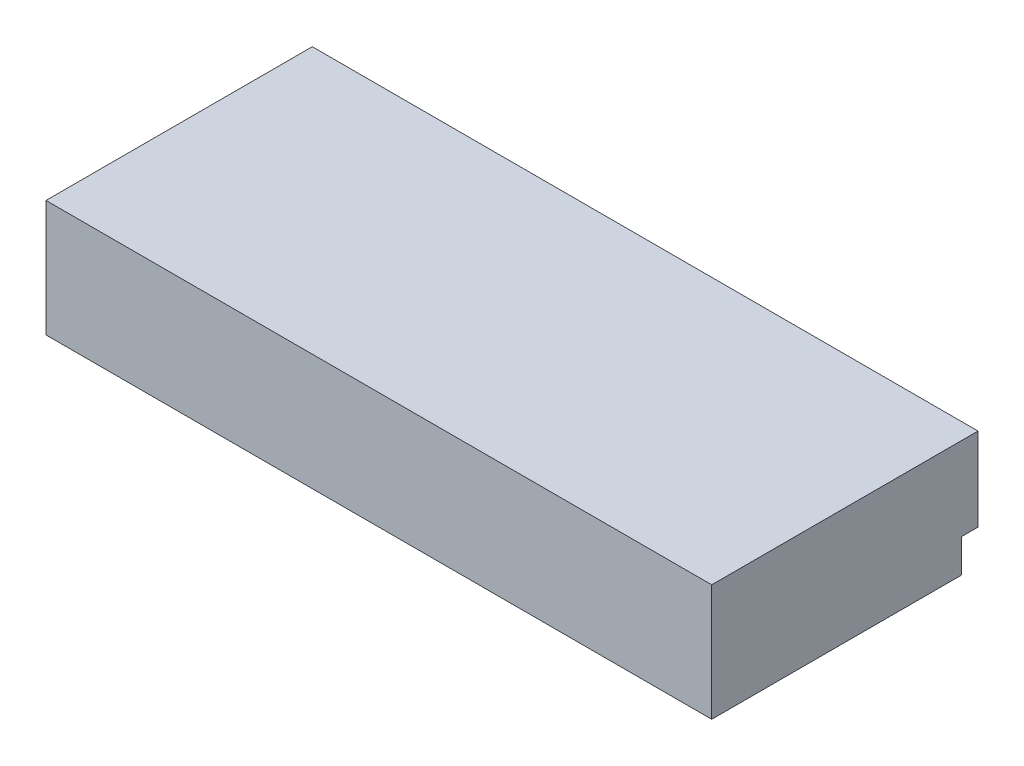
ISO-10303-21;
HEADER;
FILE_DESCRIPTION(('STEP AP214'),'2;1');
FILE_NAME('part.step','',(''),(''),'','','');
FILE_SCHEMA(('AUTOMOTIVE_DESIGN { 1 0 10303 214 1 1 1 1 }'));
ENDSEC;
DATA;
#1=APPLICATION_CONTEXT('core data for automotive mechanical design processes');
#2=APPLICATION_PROTOCOL_DEFINITION('international standard','automotive_design',2000,#1);
#3=PRODUCT_CONTEXT('',#1,'mechanical');
#4=PRODUCT('Part','Part','',(#3));
#5=PRODUCT_RELATED_PRODUCT_CATEGORY('part','',(#4));
#6=PRODUCT_DEFINITION_FORMATION('','',#4);
#7=PRODUCT_DEFINITION_CONTEXT('part definition',#1,'design');
#8=PRODUCT_DEFINITION('design','',#6,#7);
#9=PRODUCT_DEFINITION_SHAPE('','',#8);
#10=(LENGTH_UNIT() NAMED_UNIT(*) SI_UNIT(.MILLI.,.METRE.));
#11=(NAMED_UNIT(*) PLANE_ANGLE_UNIT() SI_UNIT($,.RADIAN.));
#12=(NAMED_UNIT(*) SI_UNIT($,.STERADIAN.) SOLID_ANGLE_UNIT());
#13=UNCERTAINTY_MEASURE_WITH_UNIT(LENGTH_MEASURE(1.E-05),#10,'distance_accuracy_value','');
#14=(GEOMETRIC_REPRESENTATION_CONTEXT(3) GLOBAL_UNCERTAINTY_ASSIGNED_CONTEXT((#13)) GLOBAL_UNIT_ASSIGNED_CONTEXT((#10,
#11,#12)) REPRESENTATION_CONTEXT('',''));
#15=CARTESIAN_POINT('',(0.,0.,0.));
#16=DIRECTION('',(0.,0.,1.));
#17=DIRECTION('',(1.,0.,0.));
#18=AXIS2_PLACEMENT_3D('',#15,#16,#17);
#19=CARTESIAN_POINT('',(100.,35.,40.));
#20=DIRECTION('',(-1.,0.,0.));
#21=DIRECTION('',(0.,0.,1.));
#22=AXIS2_PLACEMENT_3D('',#19,#20,#21);
#23=PLANE('',#22);
#24=DIRECTION('',(0.,0.,-1.));
#25=VECTOR('',#24,1.);
#26=CARTESIAN_POINT('',(100.,0.,40.));
#27=LINE('',#26,#25);
#28=CARTESIAN_POINT('',(100.,0.,40.));
#29=VERTEX_POINT('',#28);
#30=CARTESIAN_POINT('',(100.,0.,-35.));
#31=VERTEX_POINT('',#30);
#32=EDGE_CURVE('E123',#29,#31,#27,.T.);
#33=ORIENTED_EDGE('',*,*,#32,.T.);
#34=DIRECTION('',(0.,-1.,0.));
#35=VECTOR('',#34,1.);
#36=CARTESIAN_POINT('',(100.,0.,-35.));
#37=LINE('',#36,#35);
#38=CARTESIAN_POINT('',(100.,9.99999999999999,-35.));
#39=VERTEX_POINT('',#38);
#40=EDGE_CURVE('E48',#39,#31,#37,.T.);
#41=ORIENTED_EDGE('',*,*,#40,.F.);
#42=DIRECTION('',(0.,0.,1.));
#43=VECTOR('',#42,1.);
#44=CARTESIAN_POINT('',(100.,9.99999999999998,-40.));
#45=LINE('',#44,#43);
#46=CARTESIAN_POINT('',(100.,9.99999999999998,-40.));
#47=VERTEX_POINT('',#46);
#48=EDGE_CURVE('E134',#47,#39,#45,.T.);
#49=ORIENTED_EDGE('',*,*,#48,.F.);
#50=DIRECTION('',(0.,-1.,0.));
#51=VECTOR('',#50,1.);
#52=CARTESIAN_POINT('',(99.9999999999999,35.,-40.));
#53=LINE('',#52,#51);
#54=CARTESIAN_POINT('',(99.9999999999999,35.,-40.));
#55=VERTEX_POINT('',#54);
#56=EDGE_CURVE('E11',#55,#47,#53,.T.);
#57=ORIENTED_EDGE('',*,*,#56,.F.);
#58=DIRECTION('',(0.,0.,-1.));
#59=VECTOR('',#58,1.);
#60=CARTESIAN_POINT('',(100.,35.,40.));
#61=LINE('',#60,#59);
#62=CARTESIAN_POINT('',(100.,35.,40.));
#63=VERTEX_POINT('',#62);
#64=EDGE_CURVE('E120',#63,#55,#61,.T.);
#65=ORIENTED_EDGE('',*,*,#64,.F.);
#66=DIRECTION('',(0.,-1.,0.));
#67=VECTOR('',#66,1.);
#68=CARTESIAN_POINT('',(100.,35.,40.));
#69=LINE('',#68,#67);
#70=EDGE_CURVE('E115',#63,#29,#69,.T.);
#71=ORIENTED_EDGE('',*,*,#70,.T.);
#72=EDGE_LOOP('',(#33,#41,#49,#57,#65,#71));
#73=FACE_BOUND('',#72,.T.);
#74=ADVANCED_FACE('F34',(#73),#23,.F.);
#75=CARTESIAN_POINT('',(-99.9999999999999,35.,-40.));
#76=DIRECTION('',(0.,0.,1.));
#77=DIRECTION('',(1.,0.,0.));
#78=AXIS2_PLACEMENT_3D('',#75,#76,#77);
#79=PLANE('',#78);
#80=ORIENTED_EDGE('',*,*,#56,.T.);
#81=DIRECTION('',(1.,0.,0.));
#82=VECTOR('',#81,1.);
#83=CARTESIAN_POINT('',(-100.,10.,-40.));
#84=LINE('',#83,#82);
#85=CARTESIAN_POINT('',(-100.,10.,-40.));
#86=VERTEX_POINT('',#85);
#87=EDGE_CURVE('E98',#86,#47,#84,.T.);
#88=ORIENTED_EDGE('',*,*,#87,.F.);
#89=DIRECTION('',(0.,-1.,0.));
#90=VECTOR('',#89,1.);
#91=CARTESIAN_POINT('',(-99.9999999999999,35.,-40.));
#92=LINE('',#91,#90);
#93=CARTESIAN_POINT('',(-99.9999999999999,35.,-40.));
#94=VERTEX_POINT('',#93);
#95=EDGE_CURVE('E41',#94,#86,#92,.T.);
#96=ORIENTED_EDGE('',*,*,#95,.F.);
#97=DIRECTION('',(-1.,0.,0.));
#98=VECTOR('',#97,1.);
#99=CARTESIAN_POINT('',(-99.9999999999999,35.,-40.));
#100=LINE('',#99,#98);
#101=EDGE_CURVE('E79',#55,#94,#100,.T.);
#102=ORIENTED_EDGE('',*,*,#101,.F.);
#103=EDGE_LOOP('',(#80,#88,#96,#102));
#104=FACE_BOUND('',#103,.T.);
#105=ADVANCED_FACE('F107',(#104),#79,.F.);
#106=CARTESIAN_POINT('',(-100.,35.,40.));
#107=DIRECTION('',(1.,0.,0.));
#108=DIRECTION('',(0.,0.,-1.));
#109=AXIS2_PLACEMENT_3D('',#106,#107,#108);
#110=PLANE('',#109);
#111=DIRECTION('',(0.,0.,1.));
#112=VECTOR('',#111,1.);
#113=CARTESIAN_POINT('',(-100.,10.,-40.));
#114=LINE('',#113,#112);
#115=CARTESIAN_POINT('',(-100.,10.,-35.));
#116=VERTEX_POINT('',#115);
#117=EDGE_CURVE('E94',#86,#116,#114,.T.);
#118=ORIENTED_EDGE('',*,*,#117,.T.);
#119=DIRECTION('',(0.,-1.,0.));
#120=VECTOR('',#119,1.);
#121=CARTESIAN_POINT('',(-100.,0.,-35.));
#122=LINE('',#121,#120);
#123=CARTESIAN_POINT('',(-100.,0.,-35.));
#124=VERTEX_POINT('',#123);
#125=EDGE_CURVE('E105',#116,#124,#122,.T.);
#126=ORIENTED_EDGE('',*,*,#125,.T.);
#127=DIRECTION('',(0.,0.,1.));
#128=VECTOR('',#127,1.);
#129=CARTESIAN_POINT('',(-100.,0.,40.));
#130=LINE('',#129,#128);
#131=CARTESIAN_POINT('',(-100.,0.,40.));
#132=VERTEX_POINT('',#131);
#133=EDGE_CURVE('E121',#124,#132,#130,.T.);
#134=ORIENTED_EDGE('',*,*,#133,.T.);
#135=DIRECTION('',(0.,-1.,0.));
#136=VECTOR('',#135,1.);
#137=CARTESIAN_POINT('',(-100.,35.,40.));
#138=LINE('',#137,#136);
#139=CARTESIAN_POINT('',(-100.,35.,40.));
#140=VERTEX_POINT('',#139);
#141=EDGE_CURVE('E114',#140,#132,#138,.T.);
#142=ORIENTED_EDGE('',*,*,#141,.F.);
#143=DIRECTION('',(0.,0.,1.));
#144=VECTOR('',#143,1.);
#145=CARTESIAN_POINT('',(-100.,35.,40.));
#146=LINE('',#145,#144);
#147=EDGE_CURVE('E113',#94,#140,#146,.T.);
#148=ORIENTED_EDGE('',*,*,#147,.F.);
#149=ORIENTED_EDGE('',*,*,#95,.T.);
#150=EDGE_LOOP('',(#118,#126,#134,#142,#148,#149));
#151=FACE_BOUND('',#150,.T.);
#152=ADVANCED_FACE('F111',(#151),#110,.F.);
#153=CARTESIAN_POINT('',(-100.,35.,40.));
#154=DIRECTION('',(0.,0.,-1.));
#155=DIRECTION('',(-1.,0.,0.));
#156=AXIS2_PLACEMENT_3D('',#153,#154,#155);
#157=PLANE('',#156);
#158=DIRECTION('',(1.,0.,0.));
#159=VECTOR('',#158,1.);
#160=CARTESIAN_POINT('',(-100.,0.,40.));
#161=LINE('',#160,#159);
#162=EDGE_CURVE('E72',#132,#29,#161,.T.);
#163=ORIENTED_EDGE('',*,*,#162,.T.);
#164=ORIENTED_EDGE('',*,*,#70,.F.);
#165=DIRECTION('',(1.,0.,0.));
#166=VECTOR('',#165,1.);
#167=CARTESIAN_POINT('',(-100.,35.,40.));
#168=LINE('',#167,#166);
#169=EDGE_CURVE('E57',#140,#63,#168,.T.);
#170=ORIENTED_EDGE('',*,*,#169,.F.);
#171=ORIENTED_EDGE('',*,*,#141,.T.);
#172=EDGE_LOOP('',(#163,#164,#170,#171));
#173=FACE_BOUND('',#172,.T.);
#174=ADVANCED_FACE('F142',(#173),#157,.F.);
#175=CARTESIAN_POINT('',(0.,35.,0.));
#176=DIRECTION('',(0.,-1.,0.));
#177=DIRECTION('',(0.,0.,-1.));
#178=AXIS2_PLACEMENT_3D('',#175,#176,#177);
#179=PLANE('',#178);
#180=ORIENTED_EDGE('',*,*,#64,.T.);
#181=ORIENTED_EDGE('',*,*,#101,.T.);
#182=ORIENTED_EDGE('',*,*,#147,.T.);
#183=ORIENTED_EDGE('',*,*,#169,.T.);
#184=EDGE_LOOP('',(#180,#181,#182,#183));
#185=FACE_BOUND('',#184,.T.);
#186=ADVANCED_FACE('F144',(#185),#179,.F.);
#187=CARTESIAN_POINT('',(0.,0.,0.));
#188=DIRECTION('',(0.,-1.,0.));
#189=DIRECTION('',(0.,0.,-1.));
#190=AXIS2_PLACEMENT_3D('',#187,#188,#189);
#191=PLANE('',#190);
#192=DIRECTION('',(1.,0.,0.));
#193=VECTOR('',#192,1.);
#194=CARTESIAN_POINT('',(-100.,0.,-35.));
#195=LINE('',#194,#193);
#196=EDGE_CURVE('E126',#124,#31,#195,.T.);
#197=ORIENTED_EDGE('',*,*,#196,.T.);
#198=ORIENTED_EDGE('',*,*,#32,.F.);
#199=ORIENTED_EDGE('',*,*,#162,.F.);
#200=ORIENTED_EDGE('',*,*,#133,.F.);
#201=EDGE_LOOP('',(#197,#198,#199,#200));
#202=FACE_BOUND('',#201,.T.);
#203=ADVANCED_FACE('F138',(#202),#191,.T.);
#204=CARTESIAN_POINT('',(-100.,0.,-35.));
#205=DIRECTION('',(0.,0.,1.));
#206=DIRECTION('',(1.,0.,0.));
#207=AXIS2_PLACEMENT_3D('',#204,#205,#206);
#208=PLANE('',#207);
#209=ORIENTED_EDGE('',*,*,#40,.T.);
#210=ORIENTED_EDGE('',*,*,#196,.F.);
#211=ORIENTED_EDGE('',*,*,#125,.F.);
#212=DIRECTION('',(1.,0.,0.));
#213=VECTOR('',#212,1.);
#214=CARTESIAN_POINT('',(-100.,10.,-35.));
#215=LINE('',#214,#213);
#216=EDGE_CURVE('E100',#116,#39,#215,.T.);
#217=ORIENTED_EDGE('',*,*,#216,.T.);
#218=EDGE_LOOP('',(#209,#210,#211,#217));
#219=FACE_BOUND('',#218,.T.);
#220=ADVANCED_FACE('F182',(#219),#208,.F.);
#221=CARTESIAN_POINT('',(-100.,10.,-40.));
#222=DIRECTION('',(0.,1.,0.));
#223=DIRECTION('',(0.,0.,1.));
#224=AXIS2_PLACEMENT_3D('',#221,#222,#223);
#225=PLANE('',#224);
#226=ORIENTED_EDGE('',*,*,#48,.T.);
#227=ORIENTED_EDGE('',*,*,#216,.F.);
#228=ORIENTED_EDGE('',*,*,#117,.F.);
#229=ORIENTED_EDGE('',*,*,#87,.T.);
#230=EDGE_LOOP('',(#226,#227,#228,#229));
#231=FACE_BOUND('',#230,.T.);
#232=ADVANCED_FACE('F97',(#231),#225,.F.);
#233=CLOSED_SHELL('',(#74,#105,#152,#174,#186,#203,#220,#232));
#234=MANIFOLD_SOLID_BREP('B2',#233);
#235=ADVANCED_BREP_SHAPE_REPRESENTATION('',(#18,#234),#14);
#236=SHAPE_DEFINITION_REPRESENTATION(#9,#235);
ENDSEC;
END-ISO-10303-21;
